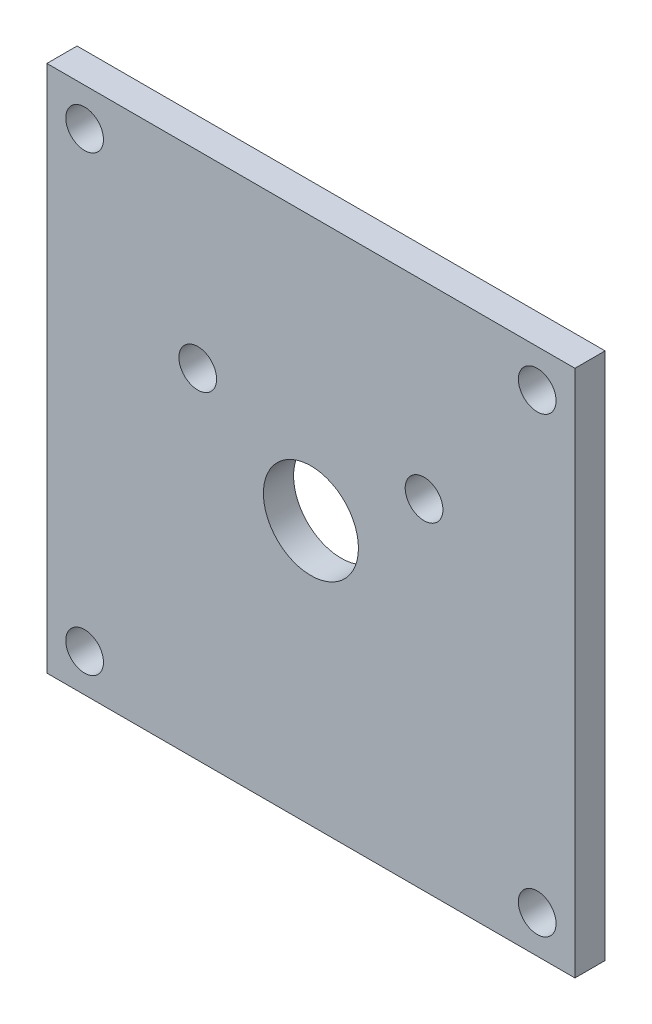
ISO-10303-21;
HEADER;
FILE_DESCRIPTION(('STEP AP214'),'2;1');
FILE_NAME('part.step','',(''),(''),'','','');
FILE_SCHEMA(('AUTOMOTIVE_DESIGN { 1 0 10303 214 1 1 1 1 }'));
ENDSEC;
DATA;
#1=APPLICATION_CONTEXT('core data for automotive mechanical design processes');
#2=APPLICATION_PROTOCOL_DEFINITION('international standard','automotive_design',2000,#1);
#3=PRODUCT_CONTEXT('',#1,'mechanical');
#4=PRODUCT('Part','Part','',(#3));
#5=PRODUCT_RELATED_PRODUCT_CATEGORY('part','',(#4));
#6=PRODUCT_DEFINITION_FORMATION('','',#4);
#7=PRODUCT_DEFINITION_CONTEXT('part definition',#1,'design');
#8=PRODUCT_DEFINITION('design','',#6,#7);
#9=PRODUCT_DEFINITION_SHAPE('','',#8);
#10=(LENGTH_UNIT() NAMED_UNIT(*) SI_UNIT(.MILLI.,.METRE.));
#11=(NAMED_UNIT(*) PLANE_ANGLE_UNIT() SI_UNIT($,.RADIAN.));
#12=(NAMED_UNIT(*) SI_UNIT($,.STERADIAN.) SOLID_ANGLE_UNIT());
#13=UNCERTAINTY_MEASURE_WITH_UNIT(LENGTH_MEASURE(1.E-05),#10,'distance_accuracy_value','');
#14=(GEOMETRIC_REPRESENTATION_CONTEXT(3) GLOBAL_UNCERTAINTY_ASSIGNED_CONTEXT((#13)) GLOBAL_UNIT_ASSIGNED_CONTEXT((#10,
#11,#12)) REPRESENTATION_CONTEXT('',''));
#15=CARTESIAN_POINT('',(0.,0.,0.));
#16=DIRECTION('',(0.,0.,1.));
#17=DIRECTION('',(1.,0.,0.));
#18=AXIS2_PLACEMENT_3D('',#15,#16,#17);
#19=CARTESIAN_POINT('',(0.,0.,2.54));
#20=DIRECTION('',(1.,0.,0.));
#21=DIRECTION('',(0.,0.,-1.));
#22=AXIS2_PLACEMENT_3D('',#19,#20,#21);
#23=PLANE('',#22);
#24=DIRECTION('',(0.,-1.,0.));
#25=VECTOR('',#24,1.);
#26=CARTESIAN_POINT('',(0.,0.,-2.54));
#27=LINE('',#26,#25);
#28=CARTESIAN_POINT('',(0.,88.9,-2.54));
#29=VERTEX_POINT('',#28);
#30=CARTESIAN_POINT('',(0.,0.,-2.54));
#31=VERTEX_POINT('',#30);
#32=EDGE_CURVE('E96',#29,#31,#27,.T.);
#33=ORIENTED_EDGE('',*,*,#32,.T.);
#34=DIRECTION('',(0.,0.,-1.));
#35=VECTOR('',#34,1.);
#36=CARTESIAN_POINT('',(0.,0.,2.54));
#37=LINE('',#36,#35);
#38=CARTESIAN_POINT('',(0.,0.,2.54));
#39=VERTEX_POINT('',#38);
#40=EDGE_CURVE('E11',#39,#31,#37,.T.);
#41=ORIENTED_EDGE('',*,*,#40,.F.);
#42=DIRECTION('',(0.,-1.,0.));
#43=VECTOR('',#42,1.);
#44=CARTESIAN_POINT('',(0.,0.,2.54));
#45=LINE('',#44,#43);
#46=CARTESIAN_POINT('',(0.,88.9,2.54));
#47=VERTEX_POINT('',#46);
#48=EDGE_CURVE('E84',#47,#39,#45,.T.);
#49=ORIENTED_EDGE('',*,*,#48,.F.);
#50=DIRECTION('',(0.,0.,-1.));
#51=VECTOR('',#50,1.);
#52=CARTESIAN_POINT('',(0.,88.9,2.54));
#53=LINE('',#52,#51);
#54=EDGE_CURVE('E92',#47,#29,#53,.T.);
#55=ORIENTED_EDGE('',*,*,#54,.T.);
#56=EDGE_LOOP('',(#33,#41,#49,#55));
#57=FACE_BOUND('',#56,.T.);
#58=ADVANCED_FACE('F33',(#57),#23,.F.);
#59=CARTESIAN_POINT('',(0.,0.,2.54));
#60=DIRECTION('',(0.,1.,0.));
#61=DIRECTION('',(0.,0.,1.));
#62=AXIS2_PLACEMENT_3D('',#59,#60,#61);
#63=PLANE('',#62);
#64=DIRECTION('',(1.,0.,0.));
#65=VECTOR('',#64,1.);
#66=CARTESIAN_POINT('',(0.,0.,-2.54));
#67=LINE('',#66,#65);
#68=CARTESIAN_POINT('',(88.9,0.,-2.54));
#69=VERTEX_POINT('',#68);
#70=EDGE_CURVE('E88',#31,#69,#67,.T.);
#71=ORIENTED_EDGE('',*,*,#70,.T.);
#72=DIRECTION('',(0.,0.,-1.));
#73=VECTOR('',#72,1.);
#74=CARTESIAN_POINT('',(88.9,0.,2.54));
#75=LINE('',#74,#73);
#76=CARTESIAN_POINT('',(88.9,0.,2.54));
#77=VERTEX_POINT('',#76);
#78=EDGE_CURVE('E41',#77,#69,#75,.T.);
#79=ORIENTED_EDGE('',*,*,#78,.F.);
#80=DIRECTION('',(1.,0.,0.));
#81=VECTOR('',#80,1.);
#82=CARTESIAN_POINT('',(0.,0.,2.54));
#83=LINE('',#82,#81);
#84=EDGE_CURVE('E79',#39,#77,#83,.T.);
#85=ORIENTED_EDGE('',*,*,#84,.F.);
#86=ORIENTED_EDGE('',*,*,#40,.T.);
#87=EDGE_LOOP('',(#71,#79,#85,#86));
#88=FACE_BOUND('',#87,.T.);
#89=ADVANCED_FACE('F87',(#88),#63,.F.);
#90=CARTESIAN_POINT('',(88.9,0.,2.54));
#91=DIRECTION('',(-1.,0.,0.));
#92=DIRECTION('',(0.,0.,1.));
#93=AXIS2_PLACEMENT_3D('',#90,#91,#92);
#94=PLANE('',#93);
#95=DIRECTION('',(0.,1.,0.));
#96=VECTOR('',#95,1.);
#97=CARTESIAN_POINT('',(88.9,0.,-2.54));
#98=LINE('',#97,#96);
#99=CARTESIAN_POINT('',(88.9,88.9,-2.54));
#100=VERTEX_POINT('',#99);
#101=EDGE_CURVE('E66',#69,#100,#98,.T.);
#102=ORIENTED_EDGE('',*,*,#101,.T.);
#103=DIRECTION('',(0.,0.,-1.));
#104=VECTOR('',#103,1.);
#105=CARTESIAN_POINT('',(88.9,88.9,2.54));
#106=LINE('',#105,#104);
#107=CARTESIAN_POINT('',(88.9,88.9,2.54));
#108=VERTEX_POINT('',#107);
#109=EDGE_CURVE('E89',#108,#100,#106,.T.);
#110=ORIENTED_EDGE('',*,*,#109,.F.);
#111=DIRECTION('',(0.,1.,0.));
#112=VECTOR('',#111,1.);
#113=CARTESIAN_POINT('',(88.9,0.,2.54));
#114=LINE('',#113,#112);
#115=EDGE_CURVE('E82',#77,#108,#114,.T.);
#116=ORIENTED_EDGE('',*,*,#115,.F.);
#117=ORIENTED_EDGE('',*,*,#78,.T.);
#118=EDGE_LOOP('',(#102,#110,#116,#117));
#119=FACE_BOUND('',#118,.T.);
#120=ADVANCED_FACE('F90',(#119),#94,.F.);
#121=CARTESIAN_POINT('',(0.,88.9,2.54));
#122=DIRECTION('',(0.,-1.,0.));
#123=DIRECTION('',(0.,0.,-1.));
#124=AXIS2_PLACEMENT_3D('',#121,#122,#123);
#125=PLANE('',#124);
#126=DIRECTION('',(-1.,0.,0.));
#127=VECTOR('',#126,1.);
#128=CARTESIAN_POINT('',(0.,88.9,-2.54));
#129=LINE('',#128,#127);
#130=EDGE_CURVE('E72',#100,#29,#129,.T.);
#131=ORIENTED_EDGE('',*,*,#130,.T.);
#132=ORIENTED_EDGE('',*,*,#54,.F.);
#133=DIRECTION('',(-1.,0.,0.));
#134=VECTOR('',#133,1.);
#135=CARTESIAN_POINT('',(0.,88.9,2.54));
#136=LINE('',#135,#134);
#137=EDGE_CURVE('E49',#108,#47,#136,.T.);
#138=ORIENTED_EDGE('',*,*,#137,.F.);
#139=ORIENTED_EDGE('',*,*,#109,.T.);
#140=EDGE_LOOP('',(#131,#132,#138,#139));
#141=FACE_BOUND('',#140,.T.);
#142=ADVANCED_FACE('F104',(#141),#125,.F.);
#143=CARTESIAN_POINT('',(0.,0.,2.54));
#144=DIRECTION('',(0.,0.,-1.));
#145=DIRECTION('',(-1.,0.,0.));
#146=AXIS2_PLACEMENT_3D('',#143,#144,#145);
#147=PLANE('',#146);
#148=CARTESIAN_POINT('',(44.45,44.45,2.54));
#149=DIRECTION('',(0.,0.,1.));
#150=DIRECTION('',(1.,0.,0.));
#151=AXIS2_PLACEMENT_3D('',#148,#149,#150);
#152=CIRCLE('',#151,8.001);
#153=CARTESIAN_POINT('',(52.451,44.45,2.54));
#154=VERTEX_POINT('',#153);
#155=EDGE_CURVE('E128',#154,#154,#152,.T.);
#156=ORIENTED_EDGE('',*,*,#155,.F.);
#157=EDGE_LOOP('',(#156));
#158=FACE_BOUND('',#157,.T.);
#159=CARTESIAN_POINT('',(6.34999999999999,6.35000000000001,2.54));
#160=DIRECTION('',(0.,0.,1.));
#161=DIRECTION('',(1.,0.,0.));
#162=AXIS2_PLACEMENT_3D('',#159,#160,#161);
#163=CIRCLE('',#162,3.175);
#164=CARTESIAN_POINT('',(9.52499999999999,6.35000000000001,2.54));
#165=VERTEX_POINT('',#164);
#166=EDGE_CURVE('E135',#165,#165,#163,.T.);
#167=ORIENTED_EDGE('',*,*,#166,.F.);
#168=EDGE_LOOP('',(#167));
#169=FACE_BOUND('',#168,.T.);
#170=CARTESIAN_POINT('',(82.55,6.35000000000002,2.54));
#171=DIRECTION('',(0.,0.,1.));
#172=DIRECTION('',(1.,0.,0.));
#173=AXIS2_PLACEMENT_3D('',#170,#171,#172);
#174=CIRCLE('',#173,3.175);
#175=CARTESIAN_POINT('',(85.725,6.35000000000002,2.54));
#176=VERTEX_POINT('',#175);
#177=EDGE_CURVE('E116',#176,#176,#174,.T.);
#178=ORIENTED_EDGE('',*,*,#177,.F.);
#179=EDGE_LOOP('',(#178));
#180=FACE_BOUND('',#179,.T.);
#181=CARTESIAN_POINT('',(6.34999999999999,82.55,2.54));
#182=DIRECTION('',(0.,0.,1.));
#183=DIRECTION('',(1.,0.,0.));
#184=AXIS2_PLACEMENT_3D('',#181,#182,#183);
#185=CIRCLE('',#184,3.175);
#186=CARTESIAN_POINT('',(9.52499999999999,82.55,2.54));
#187=VERTEX_POINT('',#186);
#188=EDGE_CURVE('E123',#187,#187,#185,.T.);
#189=ORIENTED_EDGE('',*,*,#188,.F.);
#190=EDGE_LOOP('',(#189));
#191=FACE_BOUND('',#190,.T.);
#192=CARTESIAN_POINT('',(25.4,57.15,2.54));
#193=DIRECTION('',(0.,0.,1.));
#194=DIRECTION('',(1.,0.,0.));
#195=AXIS2_PLACEMENT_3D('',#192,#193,#194);
#196=CIRCLE('',#195,3.175);
#197=CARTESIAN_POINT('',(28.575,57.15,2.54));
#198=VERTEX_POINT('',#197);
#199=EDGE_CURVE('E146',#198,#198,#196,.T.);
#200=ORIENTED_EDGE('',*,*,#199,.F.);
#201=EDGE_LOOP('',(#200));
#202=FACE_BOUND('',#201,.T.);
#203=CARTESIAN_POINT('',(63.5,57.15,2.54));
#204=DIRECTION('',(0.,0.,1.));
#205=DIRECTION('',(1.,0.,0.));
#206=AXIS2_PLACEMENT_3D('',#203,#204,#205);
#207=CIRCLE('',#206,3.175);
#208=CARTESIAN_POINT('',(66.675,57.15,2.54));
#209=VERTEX_POINT('',#208);
#210=EDGE_CURVE('E140',#209,#209,#207,.T.);
#211=ORIENTED_EDGE('',*,*,#210,.F.);
#212=EDGE_LOOP('',(#211));
#213=FACE_BOUND('',#212,.T.);
#214=CARTESIAN_POINT('',(82.55,82.55,2.54));
#215=DIRECTION('',(0.,0.,1.));
#216=DIRECTION('',(1.,0.,0.));
#217=AXIS2_PLACEMENT_3D('',#214,#215,#216);
#218=CIRCLE('',#217,3.175);
#219=CARTESIAN_POINT('',(85.725,82.55,2.54));
#220=VERTEX_POINT('',#219);
#221=EDGE_CURVE('E110',#220,#220,#218,.T.);
#222=ORIENTED_EDGE('',*,*,#221,.F.);
#223=EDGE_LOOP('',(#222));
#224=FACE_BOUND('',#223,.T.);
#225=ORIENTED_EDGE('',*,*,#48,.T.);
#226=ORIENTED_EDGE('',*,*,#84,.T.);
#227=ORIENTED_EDGE('',*,*,#115,.T.);
#228=ORIENTED_EDGE('',*,*,#137,.T.);
#229=EDGE_LOOP('',(#225,#226,#227,#228));
#230=FACE_BOUND('',#229,.T.);
#231=ADVANCED_FACE('F80',(#158,#169,#180,#191,#202,#213,#224,#230),#147,.F.);
#232=CARTESIAN_POINT('',(0.,0.,-2.54));
#233=DIRECTION('',(0.,0.,-1.));
#234=DIRECTION('',(-1.,0.,0.));
#235=AXIS2_PLACEMENT_3D('',#232,#233,#234);
#236=PLANE('',#235);
#237=CARTESIAN_POINT('',(44.45,44.45,-2.54));
#238=DIRECTION('',(0.,0.,1.));
#239=DIRECTION('',(1.,0.,0.));
#240=AXIS2_PLACEMENT_3D('',#237,#238,#239);
#241=CIRCLE('',#240,8.001);
#242=CARTESIAN_POINT('',(52.451,44.45,-2.54));
#243=VERTEX_POINT('',#242);
#244=EDGE_CURVE('E131',#243,#243,#241,.T.);
#245=ORIENTED_EDGE('',*,*,#244,.T.);
#246=EDGE_LOOP('',(#245));
#247=FACE_BOUND('',#246,.T.);
#248=CARTESIAN_POINT('',(6.34999999999999,6.35000000000001,-2.54));
#249=DIRECTION('',(0.,0.,1.));
#250=DIRECTION('',(1.,0.,0.));
#251=AXIS2_PLACEMENT_3D('',#248,#249,#250);
#252=CIRCLE('',#251,3.175);
#253=CARTESIAN_POINT('',(9.52499999999999,6.35000000000001,-2.54));
#254=VERTEX_POINT('',#253);
#255=EDGE_CURVE('E120',#254,#254,#252,.T.);
#256=ORIENTED_EDGE('',*,*,#255,.T.);
#257=EDGE_LOOP('',(#256));
#258=FACE_BOUND('',#257,.T.);
#259=CARTESIAN_POINT('',(82.55,6.35000000000002,-2.54));
#260=DIRECTION('',(0.,0.,1.));
#261=DIRECTION('',(1.,0.,0.));
#262=AXIS2_PLACEMENT_3D('',#259,#260,#261);
#263=CIRCLE('',#262,3.175);
#264=CARTESIAN_POINT('',(85.725,6.35000000000002,-2.54));
#265=VERTEX_POINT('',#264);
#266=EDGE_CURVE('E119',#265,#265,#263,.T.);
#267=ORIENTED_EDGE('',*,*,#266,.T.);
#268=EDGE_LOOP('',(#267));
#269=FACE_BOUND('',#268,.T.);
#270=CARTESIAN_POINT('',(6.34999999999999,82.55,-2.54));
#271=DIRECTION('',(0.,0.,1.));
#272=DIRECTION('',(1.,0.,0.));
#273=AXIS2_PLACEMENT_3D('',#270,#271,#272);
#274=CIRCLE('',#273,3.175);
#275=CARTESIAN_POINT('',(9.52499999999999,82.55,-2.54));
#276=VERTEX_POINT('',#275);
#277=EDGE_CURVE('E113',#276,#276,#274,.T.);
#278=ORIENTED_EDGE('',*,*,#277,.T.);
#279=EDGE_LOOP('',(#278));
#280=FACE_BOUND('',#279,.T.);
#281=CARTESIAN_POINT('',(25.4,57.15,-2.54));
#282=DIRECTION('',(0.,0.,1.));
#283=DIRECTION('',(1.,0.,0.));
#284=AXIS2_PLACEMENT_3D('',#281,#282,#283);
#285=CIRCLE('',#284,3.175);
#286=CARTESIAN_POINT('',(28.575,57.15,-2.54));
#287=VERTEX_POINT('',#286);
#288=EDGE_CURVE('E132',#287,#287,#285,.T.);
#289=ORIENTED_EDGE('',*,*,#288,.T.);
#290=EDGE_LOOP('',(#289));
#291=FACE_BOUND('',#290,.T.);
#292=CARTESIAN_POINT('',(63.5,57.15,-2.54));
#293=DIRECTION('',(0.,0.,1.));
#294=DIRECTION('',(1.,0.,0.));
#295=AXIS2_PLACEMENT_3D('',#292,#293,#294);
#296=CIRCLE('',#295,3.175);
#297=CARTESIAN_POINT('',(66.675,57.15,-2.54));
#298=VERTEX_POINT('',#297);
#299=EDGE_CURVE('E143',#298,#298,#296,.T.);
#300=ORIENTED_EDGE('',*,*,#299,.T.);
#301=EDGE_LOOP('',(#300));
#302=FACE_BOUND('',#301,.T.);
#303=CARTESIAN_POINT('',(82.55,82.55,-2.54));
#304=DIRECTION('',(0.,0.,1.));
#305=DIRECTION('',(1.,0.,0.));
#306=AXIS2_PLACEMENT_3D('',#303,#304,#305);
#307=CIRCLE('',#306,3.175);
#308=CARTESIAN_POINT('',(85.725,82.55,-2.54));
#309=VERTEX_POINT('',#308);
#310=EDGE_CURVE('E99',#309,#309,#307,.T.);
#311=ORIENTED_EDGE('',*,*,#310,.T.);
#312=EDGE_LOOP('',(#311));
#313=FACE_BOUND('',#312,.T.);
#314=ORIENTED_EDGE('',*,*,#32,.F.);
#315=ORIENTED_EDGE('',*,*,#130,.F.);
#316=ORIENTED_EDGE('',*,*,#101,.F.);
#317=ORIENTED_EDGE('',*,*,#70,.F.);
#318=EDGE_LOOP('',(#314,#315,#316,#317));
#319=FACE_BOUND('',#318,.T.);
#320=ADVANCED_FACE('F107',(#247,#258,#269,#280,#291,#302,#313,#319),#236,.T.);
#321=CARTESIAN_POINT('',(82.55,82.55,-2.54));
#322=DIRECTION('',(0.,0.,1.));
#323=DIRECTION('',(1.,0.,0.));
#324=AXIS2_PLACEMENT_3D('',#321,#322,#323);
#325=CYLINDRICAL_SURFACE('',#324,3.175);
#326=ORIENTED_EDGE('',*,*,#310,.F.);
#327=EDGE_LOOP('',(#326));
#328=FACE_BOUND('',#327,.T.);
#329=ORIENTED_EDGE('',*,*,#221,.T.);
#330=EDGE_LOOP('',(#329));
#331=FACE_BOUND('',#330,.T.);
#332=ADVANCED_FACE('F170',(#328,#331),#325,.F.);
#333=CARTESIAN_POINT('',(63.5,57.15,-2.54));
#334=DIRECTION('',(0.,0.,1.));
#335=DIRECTION('',(1.,0.,0.));
#336=AXIS2_PLACEMENT_3D('',#333,#334,#335);
#337=CYLINDRICAL_SURFACE('',#336,3.175);
#338=ORIENTED_EDGE('',*,*,#299,.F.);
#339=EDGE_LOOP('',(#338));
#340=FACE_BOUND('',#339,.T.);
#341=ORIENTED_EDGE('',*,*,#210,.T.);
#342=EDGE_LOOP('',(#341));
#343=FACE_BOUND('',#342,.T.);
#344=ADVANCED_FACE('F158',(#340,#343),#337,.F.);
#345=CARTESIAN_POINT('',(25.4,57.15,-2.54));
#346=DIRECTION('',(0.,0.,1.));
#347=DIRECTION('',(1.,0.,0.));
#348=AXIS2_PLACEMENT_3D('',#345,#346,#347);
#349=CYLINDRICAL_SURFACE('',#348,3.175);
#350=ORIENTED_EDGE('',*,*,#288,.F.);
#351=EDGE_LOOP('',(#350));
#352=FACE_BOUND('',#351,.T.);
#353=ORIENTED_EDGE('',*,*,#199,.T.);
#354=EDGE_LOOP('',(#353));
#355=FACE_BOUND('',#354,.T.);
#356=ADVANCED_FACE('F154',(#352,#355),#349,.F.);
#357=CARTESIAN_POINT('',(6.34999999999999,82.55,-2.54));
#358=DIRECTION('',(0.,0.,1.));
#359=DIRECTION('',(1.,0.,0.));
#360=AXIS2_PLACEMENT_3D('',#357,#358,#359);
#361=CYLINDRICAL_SURFACE('',#360,3.175);
#362=ORIENTED_EDGE('',*,*,#277,.F.);
#363=EDGE_LOOP('',(#362));
#364=FACE_BOUND('',#363,.T.);
#365=ORIENTED_EDGE('',*,*,#188,.T.);
#366=EDGE_LOOP('',(#365));
#367=FACE_BOUND('',#366,.T.);
#368=ADVANCED_FACE('F157',(#364,#367),#361,.F.);
#369=CARTESIAN_POINT('',(82.55,6.35000000000002,-2.54));
#370=DIRECTION('',(0.,0.,1.));
#371=DIRECTION('',(1.,0.,0.));
#372=AXIS2_PLACEMENT_3D('',#369,#370,#371);
#373=CYLINDRICAL_SURFACE('',#372,3.175);
#374=ORIENTED_EDGE('',*,*,#266,.F.);
#375=EDGE_LOOP('',(#374));
#376=FACE_BOUND('',#375,.T.);
#377=ORIENTED_EDGE('',*,*,#177,.T.);
#378=EDGE_LOOP('',(#377));
#379=FACE_BOUND('',#378,.T.);
#380=ADVANCED_FACE('F231',(#376,#379),#373,.F.);
#381=CARTESIAN_POINT('',(6.34999999999999,6.35000000000001,-2.54));
#382=DIRECTION('',(0.,0.,1.));
#383=DIRECTION('',(1.,0.,0.));
#384=AXIS2_PLACEMENT_3D('',#381,#382,#383);
#385=CYLINDRICAL_SURFACE('',#384,3.175);
#386=ORIENTED_EDGE('',*,*,#255,.F.);
#387=EDGE_LOOP('',(#386));
#388=FACE_BOUND('',#387,.T.);
#389=ORIENTED_EDGE('',*,*,#166,.T.);
#390=EDGE_LOOP('',(#389));
#391=FACE_BOUND('',#390,.T.);
#392=ADVANCED_FACE('F241',(#388,#391),#385,.F.);
#393=CARTESIAN_POINT('',(44.45,44.45,-2.54));
#394=DIRECTION('',(0.,0.,1.));
#395=DIRECTION('',(1.,0.,0.));
#396=AXIS2_PLACEMENT_3D('',#393,#394,#395);
#397=CYLINDRICAL_SURFACE('',#396,8.001);
#398=ORIENTED_EDGE('',*,*,#244,.F.);
#399=EDGE_LOOP('',(#398));
#400=FACE_BOUND('',#399,.T.);
#401=ORIENTED_EDGE('',*,*,#155,.T.);
#402=EDGE_LOOP('',(#401));
#403=FACE_BOUND('',#402,.T.);
#404=ADVANCED_FACE('F250',(#400,#403),#397,.F.);
#405=CLOSED_SHELL('',(#58,#89,#120,#142,#231,#320,#332,#344,#356,#368,#380,#392,#404));
#406=MANIFOLD_SOLID_BREP('B2',#405);
#407=ADVANCED_BREP_SHAPE_REPRESENTATION('',(#18,#406),#14);
#408=SHAPE_DEFINITION_REPRESENTATION(#9,#407);
ENDSEC;
END-ISO-10303-21;
